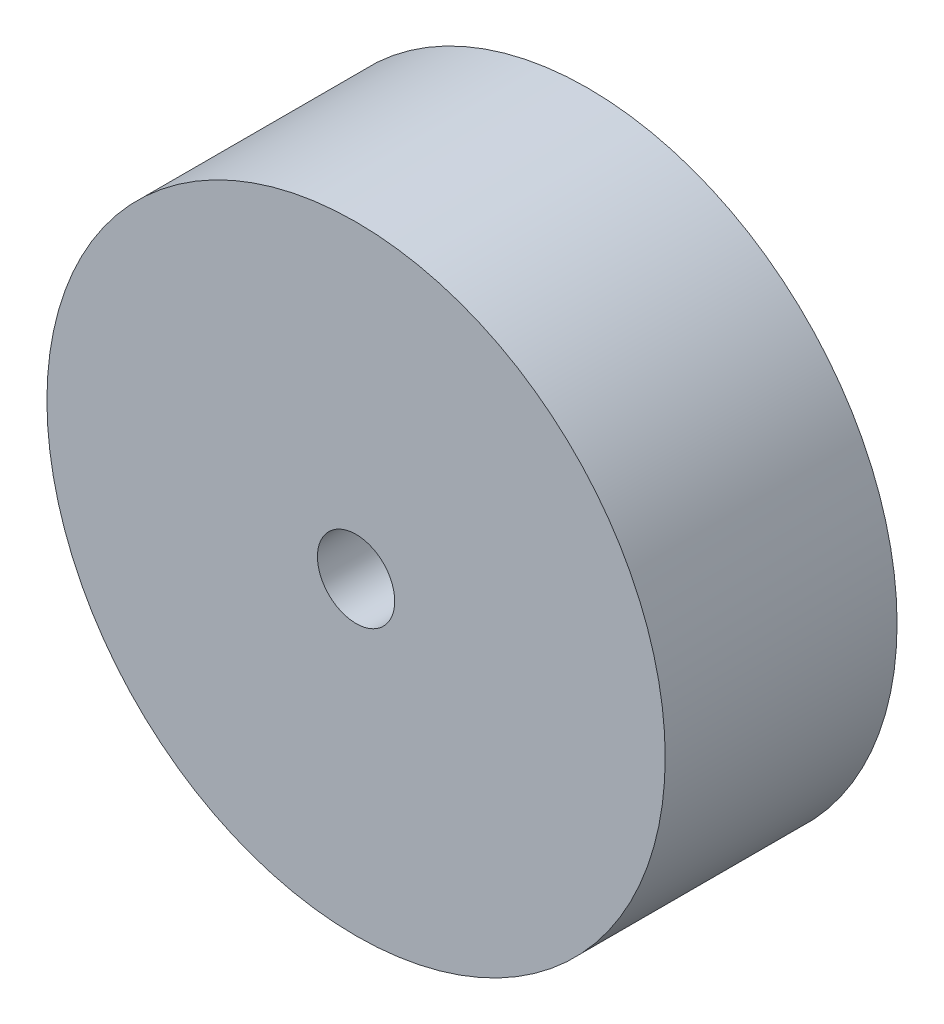
ISO-10303-21;
HEADER;
FILE_DESCRIPTION(('STEP AP214'),'2;1');
FILE_NAME('part.step','',(''),(''),'','','');
FILE_SCHEMA(('AUTOMOTIVE_DESIGN { 1 0 10303 214 1 1 1 1 }'));
ENDSEC;
DATA;
#1=APPLICATION_CONTEXT('core data for automotive mechanical design processes');
#2=APPLICATION_PROTOCOL_DEFINITION('international standard','automotive_design',2000,#1);
#3=PRODUCT_CONTEXT('',#1,'mechanical');
#4=PRODUCT('Part','Part','',(#3));
#5=PRODUCT_RELATED_PRODUCT_CATEGORY('part','',(#4));
#6=PRODUCT_DEFINITION_FORMATION('','',#4);
#7=PRODUCT_DEFINITION_CONTEXT('part definition',#1,'design');
#8=PRODUCT_DEFINITION('design','',#6,#7);
#9=PRODUCT_DEFINITION_SHAPE('','',#8);
#10=(LENGTH_UNIT() NAMED_UNIT(*) SI_UNIT(.MILLI.,.METRE.));
#11=(NAMED_UNIT(*) PLANE_ANGLE_UNIT() SI_UNIT($,.RADIAN.));
#12=(NAMED_UNIT(*) SI_UNIT($,.STERADIAN.) SOLID_ANGLE_UNIT());
#13=UNCERTAINTY_MEASURE_WITH_UNIT(LENGTH_MEASURE(1.E-05),#10,'distance_accuracy_value','');
#14=(GEOMETRIC_REPRESENTATION_CONTEXT(3) GLOBAL_UNCERTAINTY_ASSIGNED_CONTEXT((#13)) GLOBAL_UNIT_ASSIGNED_CONTEXT((#10,
#11,#12)) REPRESENTATION_CONTEXT('',''));
#15=CARTESIAN_POINT('',(0.,0.,0.));
#16=DIRECTION('',(0.,0.,1.));
#17=DIRECTION('',(1.,0.,0.));
#18=AXIS2_PLACEMENT_3D('',#15,#16,#17);
#19=CARTESIAN_POINT('',(0.,0.,76.2));
#20=DIRECTION('',(0.,0.,1.));
#21=DIRECTION('',(1.,0.,0.));
#22=AXIS2_PLACEMENT_3D('',#19,#20,#21);
#23=PLANE('',#22);
#24=CARTESIAN_POINT('',(0.,0.,76.2));
#25=DIRECTION('',(0.,0.,1.));
#26=DIRECTION('',(1.,0.,0.));
#27=AXIS2_PLACEMENT_3D('',#24,#25,#26);
#28=CIRCLE('',#27,101.6);
#29=CARTESIAN_POINT('',(101.6,0.,76.2));
#30=VERTEX_POINT('',#29);
#31=EDGE_CURVE('E10',#30,#30,#28,.T.);
#32=ORIENTED_EDGE('',*,*,#31,.T.);
#33=EDGE_LOOP('',(#32));
#34=FACE_BOUND('',#33,.T.);
#35=CARTESIAN_POINT('',(0.,0.,76.2));
#36=DIRECTION('',(0.,0.,1.));
#37=DIRECTION('',(1.,0.,0.));
#38=AXIS2_PLACEMENT_3D('',#35,#36,#37);
#39=CIRCLE('',#38,12.7);
#40=CARTESIAN_POINT('',(12.7,0.,76.2));
#41=VERTEX_POINT('',#40);
#42=EDGE_CURVE('E50',#41,#41,#39,.T.);
#43=ORIENTED_EDGE('',*,*,#42,.F.);
#44=EDGE_LOOP('',(#43));
#45=FACE_BOUND('',#44,.T.);
#46=ADVANCED_FACE('F37',(#34,#45),#23,.T.);
#47=CARTESIAN_POINT('',(0.,0.,0.));
#48=DIRECTION('',(0.,0.,1.));
#49=DIRECTION('',(1.,0.,0.));
#50=AXIS2_PLACEMENT_3D('',#47,#48,#49);
#51=PLANE('',#50);
#52=CARTESIAN_POINT('',(0.,0.,0.));
#53=DIRECTION('',(0.,0.,1.));
#54=DIRECTION('',(1.,0.,0.));
#55=AXIS2_PLACEMENT_3D('',#52,#53,#54);
#56=CIRCLE('',#55,101.6);
#57=CARTESIAN_POINT('',(101.6,0.,0.));
#58=VERTEX_POINT('',#57);
#59=EDGE_CURVE('E41',#58,#58,#56,.T.);
#60=ORIENTED_EDGE('',*,*,#59,.F.);
#61=EDGE_LOOP('',(#60));
#62=FACE_BOUND('',#61,.T.);
#63=CARTESIAN_POINT('',(0.,0.,0.));
#64=DIRECTION('',(0.,0.,1.));
#65=DIRECTION('',(1.,0.,0.));
#66=AXIS2_PLACEMENT_3D('',#63,#64,#65);
#67=CIRCLE('',#66,12.7);
#68=CARTESIAN_POINT('',(12.7,0.,0.));
#69=VERTEX_POINT('',#68);
#70=EDGE_CURVE('E52',#69,#69,#67,.T.);
#71=ORIENTED_EDGE('',*,*,#70,.T.);
#72=EDGE_LOOP('',(#71));
#73=FACE_BOUND('',#72,.T.);
#74=ADVANCED_FACE('F64',(#62,#73),#51,.F.);
#75=CARTESIAN_POINT('',(0.,0.,76.2));
#76=DIRECTION('',(0.,0.,-1.));
#77=DIRECTION('',(-1.,0.,0.));
#78=AXIS2_PLACEMENT_3D('',#75,#76,#77);
#79=CYLINDRICAL_SURFACE('',#78,101.6);
#80=ORIENTED_EDGE('',*,*,#31,.F.);
#81=EDGE_LOOP('',(#80));
#82=FACE_BOUND('',#81,.T.);
#83=ORIENTED_EDGE('',*,*,#59,.T.);
#84=EDGE_LOOP('',(#83));
#85=FACE_BOUND('',#84,.T.);
#86=ADVANCED_FACE('F39',(#82,#85),#79,.T.);
#87=CARTESIAN_POINT('',(0.,0.,76.2));
#88=DIRECTION('',(0.,0.,-1.));
#89=DIRECTION('',(-1.,0.,0.));
#90=AXIS2_PLACEMENT_3D('',#87,#88,#89);
#91=CYLINDRICAL_SURFACE('',#90,12.7);
#92=ORIENTED_EDGE('',*,*,#42,.T.);
#93=EDGE_LOOP('',(#92));
#94=FACE_BOUND('',#93,.T.);
#95=ORIENTED_EDGE('',*,*,#70,.F.);
#96=EDGE_LOOP('',(#95));
#97=FACE_BOUND('',#96,.T.);
#98=ADVANCED_FACE('F60',(#94,#97),#91,.F.);
#99=CLOSED_SHELL('',(#46,#74,#86,#98));
#100=MANIFOLD_SOLID_BREP('B2',#99);
#101=ADVANCED_BREP_SHAPE_REPRESENTATION('',(#18,#100),#14);
#102=SHAPE_DEFINITION_REPRESENTATION(#9,#101);
ENDSEC;
END-ISO-10303-21;
